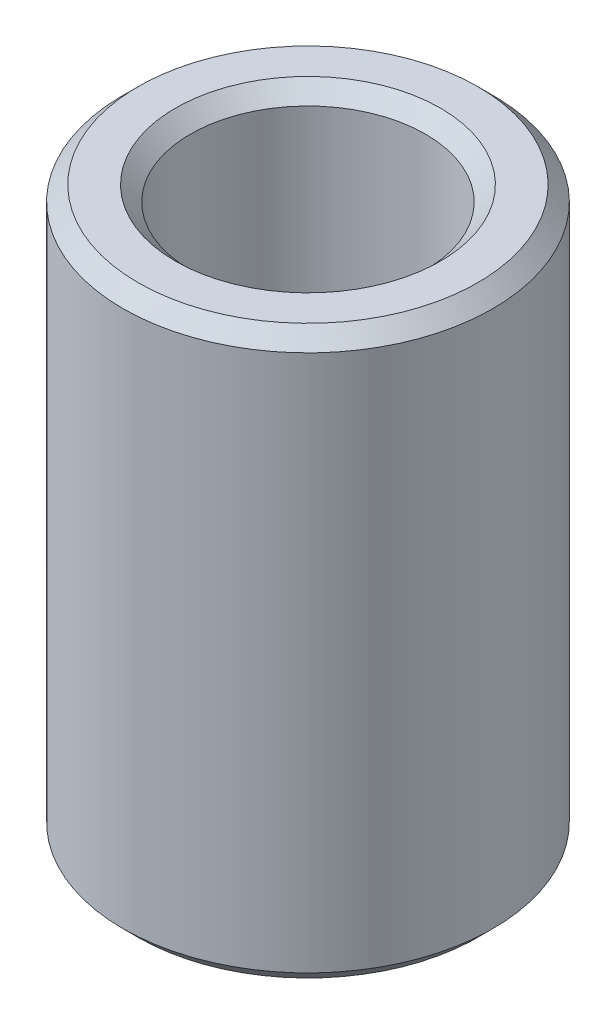
ISO-10303-21;
HEADER;
FILE_DESCRIPTION(('STEP AP214'),'2;1');
FILE_NAME('part.step','',(''),(''),'','','');
FILE_SCHEMA(('AUTOMOTIVE_DESIGN { 1 0 10303 214 1 1 1 1 }'));
ENDSEC;
DATA;
#1=APPLICATION_CONTEXT('core data for automotive mechanical design processes');
#2=APPLICATION_PROTOCOL_DEFINITION('international standard','automotive_design',2000,#1);
#3=PRODUCT_CONTEXT('',#1,'mechanical');
#4=PRODUCT('Part','Part','',(#3));
#5=PRODUCT_RELATED_PRODUCT_CATEGORY('part','',(#4));
#6=PRODUCT_DEFINITION_FORMATION('','',#4);
#7=PRODUCT_DEFINITION_CONTEXT('part definition',#1,'design');
#8=PRODUCT_DEFINITION('design','',#6,#7);
#9=PRODUCT_DEFINITION_SHAPE('','',#8);
#10=(LENGTH_UNIT() NAMED_UNIT(*) SI_UNIT(.MILLI.,.METRE.));
#11=(NAMED_UNIT(*) PLANE_ANGLE_UNIT() SI_UNIT($,.RADIAN.));
#12=(NAMED_UNIT(*) SI_UNIT($,.STERADIAN.) SOLID_ANGLE_UNIT());
#13=UNCERTAINTY_MEASURE_WITH_UNIT(LENGTH_MEASURE(1.E-05),#10,'distance_accuracy_value','');
#14=(GEOMETRIC_REPRESENTATION_CONTEXT(3) GLOBAL_UNCERTAINTY_ASSIGNED_CONTEXT((#13)) GLOBAL_UNIT_ASSIGNED_CONTEXT((#10,
#11,#12)) REPRESENTATION_CONTEXT('',''));
#15=CARTESIAN_POINT('',(0.,0.,0.));
#16=DIRECTION('',(0.,0.,1.));
#17=DIRECTION('',(1.,0.,0.));
#18=AXIS2_PLACEMENT_3D('',#15,#16,#17);
#19=CARTESIAN_POINT('',(0.,130.366750899447,0.));
#20=DIRECTION('',(0.,-1.,0.));
#21=DIRECTION('',(0.,0.,-1.));
#22=AXIS2_PLACEMENT_3D('',#19,#20,#21);
#23=CYLINDRICAL_SURFACE('',#22,42.5);
#24=CARTESIAN_POINT('',(0.,3.4499891922023,0.));
#25=DIRECTION('',(0.,1.,0.));
#26=DIRECTION('',(0.,0.,1.));
#27=AXIS2_PLACEMENT_3D('',#24,#25,#26);
#28=CIRCLE('',#27,42.5);
#29=CARTESIAN_POINT('',(0.,3.4499891922023,42.5));
#30=VERTEX_POINT('',#29);
#31=EDGE_CURVE('E10',#30,#30,#28,.T.);
#32=ORIENTED_EDGE('',*,*,#31,.T.);
#33=EDGE_LOOP('',(#32));
#34=FACE_BOUND('',#33,.T.);
#35=CARTESIAN_POINT('',(0.,126.916761707244,0.));
#36=DIRECTION('',(0.,1.,0.));
#37=DIRECTION('',(0.,0.,1.));
#38=AXIS2_PLACEMENT_3D('',#35,#36,#37);
#39=CIRCLE('',#38,42.5);
#40=CARTESIAN_POINT('',(0.,126.916761707244,42.5));
#41=VERTEX_POINT('',#40);
#42=EDGE_CURVE('E50',#41,#41,#39,.F.);
#43=ORIENTED_EDGE('',*,*,#42,.T.);
#44=EDGE_LOOP('',(#43));
#45=FACE_BOUND('',#44,.T.);
#46=ADVANCED_FACE('F39',(#34,#45),#23,.T.);
#47=CARTESIAN_POINT('',(0.,130.366750899447,0.));
#48=DIRECTION('',(0.,1.,0.));
#49=DIRECTION('',(0.,0.,1.));
#50=AXIS2_PLACEMENT_3D('',#47,#48,#49);
#51=PLANE('',#50);
#52=CARTESIAN_POINT('',(0.,130.366750899447,0.));
#53=DIRECTION('',(0.,1.,0.));
#54=DIRECTION('',(0.,0.,1.));
#55=AXIS2_PLACEMENT_3D('',#52,#53,#54);
#56=CIRCLE('',#55,30.4791820382666);
#57=CARTESIAN_POINT('',(0.,130.366750899447,30.4791820382666));
#58=VERTEX_POINT('',#57);
#59=EDGE_CURVE('E58',#58,#58,#56,.F.);
#60=ORIENTED_EDGE('',*,*,#59,.T.);
#61=EDGE_LOOP('',(#60));
#62=FACE_BOUND('',#61,.T.);
#63=CARTESIAN_POINT('',(0.,130.366750899447,0.));
#64=DIRECTION('',(0.,1.,0.));
#65=DIRECTION('',(0.,0.,1.));
#66=AXIS2_PLACEMENT_3D('',#63,#64,#65);
#67=CIRCLE('',#66,39.0500108077977);
#68=CARTESIAN_POINT('',(0.,130.366750899447,39.0500108077977));
#69=VERTEX_POINT('',#68);
#70=EDGE_CURVE('E61',#69,#69,#67,.T.);
#71=ORIENTED_EDGE('',*,*,#70,.T.);
#72=EDGE_LOOP('',(#71));
#73=FACE_BOUND('',#72,.T.);
#74=ADVANCED_FACE('F88',(#62,#73),#51,.T.);
#75=CARTESIAN_POINT('',(0.,0.,0.));
#76=DIRECTION('',(0.,1.,0.));
#77=DIRECTION('',(0.,0.,1.));
#78=AXIS2_PLACEMENT_3D('',#75,#76,#77);
#79=PLANE('',#78);
#80=CARTESIAN_POINT('',(0.,0.,0.));
#81=DIRECTION('',(0.,1.,0.));
#82=DIRECTION('',(0.,0.,1.));
#83=AXIS2_PLACEMENT_3D('',#80,#81,#82);
#84=CIRCLE('',#83,30.4791820382667);
#85=CARTESIAN_POINT('',(0.,0.,30.4791820382667));
#86=VERTEX_POINT('',#85);
#87=EDGE_CURVE('E51',#86,#86,#84,.T.);
#88=ORIENTED_EDGE('',*,*,#87,.T.);
#89=EDGE_LOOP('',(#88));
#90=FACE_BOUND('',#89,.T.);
#91=CARTESIAN_POINT('',(0.,0.,0.));
#92=DIRECTION('',(0.,1.,0.));
#93=DIRECTION('',(0.,0.,1.));
#94=AXIS2_PLACEMENT_3D('',#91,#92,#93);
#95=CIRCLE('',#94,39.0500108077977);
#96=CARTESIAN_POINT('',(0.,0.,39.0500108077977));
#97=VERTEX_POINT('',#96);
#98=EDGE_CURVE('E54',#97,#97,#95,.F.);
#99=ORIENTED_EDGE('',*,*,#98,.T.);
#100=EDGE_LOOP('',(#99));
#101=FACE_BOUND('',#100,.T.);
#102=ADVANCED_FACE('F83',(#90,#101),#79,.F.);
#103=CARTESIAN_POINT('',(0.,130.366750899447,0.));
#104=DIRECTION('',(0.,-1.,0.));
#105=DIRECTION('',(0.,0.,-1.));
#106=AXIS2_PLACEMENT_3D('',#103,#104,#105);
#107=CYLINDRICAL_SURFACE('',#106,27.0291928460643);
#108=CARTESIAN_POINT('',(0.,126.916761707245,0.));
#109=DIRECTION('',(0.,1.,0.));
#110=DIRECTION('',(0.,0.,1.));
#111=AXIS2_PLACEMENT_3D('',#108,#109,#110);
#112=CIRCLE('',#111,27.0291928460643);
#113=CARTESIAN_POINT('',(0.,126.916761707245,27.0291928460643));
#114=VERTEX_POINT('',#113);
#115=EDGE_CURVE('E67',#114,#114,#112,.T.);
#116=ORIENTED_EDGE('',*,*,#115,.T.);
#117=EDGE_LOOP('',(#116));
#118=FACE_BOUND('',#117,.T.);
#119=CARTESIAN_POINT('',(0.,3.44998919220235,0.));
#120=DIRECTION('',(0.,1.,0.));
#121=DIRECTION('',(0.,0.,1.));
#122=AXIS2_PLACEMENT_3D('',#119,#120,#121);
#123=CIRCLE('',#122,27.0291928460643);
#124=CARTESIAN_POINT('',(0.,3.44998919220235,27.0291928460643));
#125=VERTEX_POINT('',#124);
#126=EDGE_CURVE('E69',#125,#125,#123,.F.);
#127=ORIENTED_EDGE('',*,*,#126,.T.);
#128=EDGE_LOOP('',(#127));
#129=FACE_BOUND('',#128,.T.);
#130=ADVANCED_FACE('F71',(#118,#129),#107,.F.);
#131=CARTESIAN_POINT('',(0.,126.916761707245,0.));
#132=DIRECTION('',(0.,1.,0.));
#133=DIRECTION('',(0.,0.,1.));
#134=AXIS2_PLACEMENT_3D('',#131,#132,#133);
#135=CONICAL_SURFACE('',#134,27.0291928460643,0.785398163397446);
#136=ORIENTED_EDGE('',*,*,#59,.F.);
#137=EDGE_LOOP('',(#136));
#138=FACE_BOUND('',#137,.T.);
#139=ORIENTED_EDGE('',*,*,#115,.F.);
#140=EDGE_LOOP('',(#139));
#141=FACE_BOUND('',#140,.T.);
#142=ADVANCED_FACE('F77',(#138,#141),#135,.F.);
#143=CARTESIAN_POINT('',(0.,0.,0.));
#144=DIRECTION('',(0.,-1.,0.));
#145=DIRECTION('',(0.,0.,-1.));
#146=AXIS2_PLACEMENT_3D('',#143,#144,#145);
#147=CONICAL_SURFACE('',#146,30.4791820382667,0.785398163397445);
#148=ORIENTED_EDGE('',*,*,#126,.F.);
#149=EDGE_LOOP('',(#148));
#150=FACE_BOUND('',#149,.T.);
#151=ORIENTED_EDGE('',*,*,#87,.F.);
#152=EDGE_LOOP('',(#151));
#153=FACE_BOUND('',#152,.T.);
#154=ADVANCED_FACE('F73',(#150,#153),#147,.F.);
#155=CARTESIAN_POINT('',(0.,3.4499891922023,0.));
#156=DIRECTION('',(0.,1.,0.));
#157=DIRECTION('',(0.,0.,1.));
#158=AXIS2_PLACEMENT_3D('',#155,#156,#157);
#159=CONICAL_SURFACE('',#158,42.5,0.785398163397452);
#160=ORIENTED_EDGE('',*,*,#98,.F.);
#161=EDGE_LOOP('',(#160));
#162=FACE_BOUND('',#161,.T.);
#163=ORIENTED_EDGE('',*,*,#31,.F.);
#164=EDGE_LOOP('',(#163));
#165=FACE_BOUND('',#164,.T.);
#166=ADVANCED_FACE('F76',(#162,#165),#159,.T.);
#167=CARTESIAN_POINT('',(0.,130.366750899447,0.));
#168=DIRECTION('',(0.,-1.,0.));
#169=DIRECTION('',(0.,0.,-1.));
#170=AXIS2_PLACEMENT_3D('',#167,#168,#169);
#171=CONICAL_SURFACE('',#170,39.0500108077977,0.785398163397444);
#172=ORIENTED_EDGE('',*,*,#42,.F.);
#173=EDGE_LOOP('',(#172));
#174=FACE_BOUND('',#173,.T.);
#175=ORIENTED_EDGE('',*,*,#70,.F.);
#176=EDGE_LOOP('',(#175));
#177=FACE_BOUND('',#176,.T.);
#178=ADVANCED_FACE('F45',(#174,#177),#171,.T.);
#179=CLOSED_SHELL('',(#46,#74,#102,#130,#142,#154,#166,#178));
#180=MANIFOLD_SOLID_BREP('B2',#179);
#181=ADVANCED_BREP_SHAPE_REPRESENTATION('',(#18,#180),#14);
#182=SHAPE_DEFINITION_REPRESENTATION(#9,#181);
ENDSEC;
END-ISO-10303-21;
